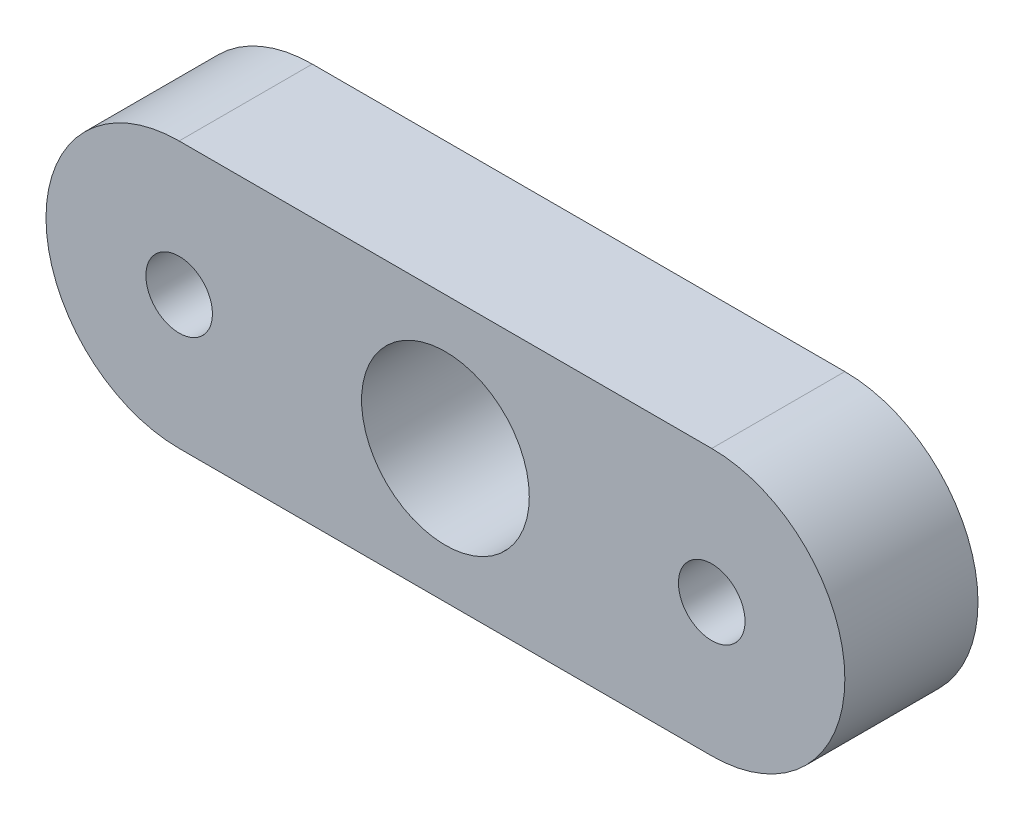
ISO-10303-21;
HEADER;
FILE_DESCRIPTION(('STEP AP214'),'2;1');
FILE_NAME('part.step','',(''),(''),'','','');
FILE_SCHEMA(('AUTOMOTIVE_DESIGN { 1 0 10303 214 1 1 1 1 }'));
ENDSEC;
DATA;
#1=APPLICATION_CONTEXT('core data for automotive mechanical design processes');
#2=APPLICATION_PROTOCOL_DEFINITION('international standard','automotive_design',2000,#1);
#3=PRODUCT_CONTEXT('',#1,'mechanical');
#4=PRODUCT('Part','Part','',(#3));
#5=PRODUCT_RELATED_PRODUCT_CATEGORY('part','',(#4));
#6=PRODUCT_DEFINITION_FORMATION('','',#4);
#7=PRODUCT_DEFINITION_CONTEXT('part definition',#1,'design');
#8=PRODUCT_DEFINITION('design','',#6,#7);
#9=PRODUCT_DEFINITION_SHAPE('','',#8);
#10=(LENGTH_UNIT() NAMED_UNIT(*) SI_UNIT(.MILLI.,.METRE.));
#11=(NAMED_UNIT(*) PLANE_ANGLE_UNIT() SI_UNIT($,.RADIAN.));
#12=(NAMED_UNIT(*) SI_UNIT($,.STERADIAN.) SOLID_ANGLE_UNIT());
#13=UNCERTAINTY_MEASURE_WITH_UNIT(LENGTH_MEASURE(1.E-05),#10,'distance_accuracy_value','');
#14=(GEOMETRIC_REPRESENTATION_CONTEXT(3) GLOBAL_UNCERTAINTY_ASSIGNED_CONTEXT((#13)) GLOBAL_UNIT_ASSIGNED_CONTEXT((#10,
#11,#12)) REPRESENTATION_CONTEXT('',''));
#15=CARTESIAN_POINT('',(0.,0.,0.));
#16=DIRECTION('',(0.,0.,1.));
#17=DIRECTION('',(1.,0.,0.));
#18=AXIS2_PLACEMENT_3D('',#15,#16,#17);
#19=CARTESIAN_POINT('',(-6.35,0.,3.175));
#20=DIRECTION('',(0.,0.,1.));
#21=DIRECTION('',(1.,0.,0.));
#22=AXIS2_PLACEMENT_3D('',#19,#20,#21);
#23=PLANE('',#22);
#24=CARTESIAN_POINT('',(-6.35,0.,3.175));
#25=DIRECTION('',(0.,0.,1.));
#26=DIRECTION('',(1.,0.,0.));
#27=AXIS2_PLACEMENT_3D('',#24,#25,#26);
#28=CIRCLE('',#27,0.793750000000001);
#29=CARTESIAN_POINT('',(-5.55625,0.,3.175));
#30=VERTEX_POINT('',#29);
#31=EDGE_CURVE('E123',#30,#30,#28,.T.);
#32=ORIENTED_EDGE('',*,*,#31,.F.);
#33=EDGE_LOOP('',(#32));
#34=FACE_BOUND('',#33,.T.);
#35=CARTESIAN_POINT('',(-6.35,0.,3.175));
#36=DIRECTION('',(0.,0.,1.));
#37=DIRECTION('',(1.,0.,0.));
#38=AXIS2_PLACEMENT_3D('',#35,#36,#37);
#39=CIRCLE('',#38,3.175);
#40=CARTESIAN_POINT('',(-6.35,3.175,3.175));
#41=VERTEX_POINT('',#40);
#42=CARTESIAN_POINT('',(-6.35,-3.175,3.175));
#43=VERTEX_POINT('',#42);
#44=EDGE_CURVE('E93',#41,#43,#39,.T.);
#45=ORIENTED_EDGE('',*,*,#44,.T.);
#46=DIRECTION('',(1.,0.,0.));
#47=VECTOR('',#46,1.);
#48=CARTESIAN_POINT('',(-6.35,-3.175,3.175));
#49=LINE('',#48,#47);
#50=CARTESIAN_POINT('',(6.35,-3.175,3.175));
#51=VERTEX_POINT('',#50);
#52=EDGE_CURVE('E88',#43,#51,#49,.T.);
#53=ORIENTED_EDGE('',*,*,#52,.T.);
#54=CARTESIAN_POINT('',(6.35,0.,3.175));
#55=DIRECTION('',(0.,0.,1.));
#56=DIRECTION('',(1.,0.,0.));
#57=AXIS2_PLACEMENT_3D('',#54,#55,#56);
#58=CIRCLE('',#57,3.175);
#59=CARTESIAN_POINT('',(6.35,3.175,3.175));
#60=VERTEX_POINT('',#59);
#61=EDGE_CURVE('E91',#51,#60,#58,.T.);
#62=ORIENTED_EDGE('',*,*,#61,.T.);
#63=DIRECTION('',(-1.,0.,0.));
#64=VECTOR('',#63,1.);
#65=CARTESIAN_POINT('',(-6.35,3.175,3.175));
#66=LINE('',#65,#64);
#67=EDGE_CURVE('E58',#60,#41,#66,.T.);
#68=ORIENTED_EDGE('',*,*,#67,.T.);
#69=EDGE_LOOP('',(#45,#53,#62,#68));
#70=FACE_BOUND('',#69,.T.);
#71=CARTESIAN_POINT('',(0.,0.,3.175));
#72=DIRECTION('',(0.,0.,1.));
#73=DIRECTION('',(1.,0.,0.));
#74=AXIS2_PLACEMENT_3D('',#71,#72,#73);
#75=CIRCLE('',#74,2.);
#76=CARTESIAN_POINT('',(2.,0.,3.175));
#77=VERTEX_POINT('',#76);
#78=EDGE_CURVE('E108',#77,#77,#75,.T.);
#79=ORIENTED_EDGE('',*,*,#78,.F.);
#80=EDGE_LOOP('',(#79));
#81=FACE_BOUND('',#80,.T.);
#82=CARTESIAN_POINT('',(6.35,0.,3.175));
#83=DIRECTION('',(0.,0.,1.));
#84=DIRECTION('',(1.,0.,0.));
#85=AXIS2_PLACEMENT_3D('',#82,#83,#84);
#86=CIRCLE('',#85,0.79375);
#87=CARTESIAN_POINT('',(7.14375,0.,3.175));
#88=VERTEX_POINT('',#87);
#89=EDGE_CURVE('E129',#88,#88,#86,.T.);
#90=ORIENTED_EDGE('',*,*,#89,.F.);
#91=EDGE_LOOP('',(#90));
#92=FACE_BOUND('',#91,.T.);
#93=ADVANCED_FACE('F41',(#34,#70,#81,#92),#23,.T.);
#94=CARTESIAN_POINT('',(-6.35,0.,0.));
#95=DIRECTION('',(0.,0.,1.));
#96=DIRECTION('',(1.,0.,0.));
#97=AXIS2_PLACEMENT_3D('',#94,#95,#96);
#98=PLANE('',#97);
#99=CARTESIAN_POINT('',(-6.35,0.,0.));
#100=DIRECTION('',(0.,0.,1.));
#101=DIRECTION('',(1.,0.,0.));
#102=AXIS2_PLACEMENT_3D('',#99,#100,#101);
#103=CIRCLE('',#102,3.175);
#104=CARTESIAN_POINT('',(-6.35,3.175,0.));
#105=VERTEX_POINT('',#104);
#106=CARTESIAN_POINT('',(-6.35,-3.175,0.));
#107=VERTEX_POINT('',#106);
#108=EDGE_CURVE('E105',#105,#107,#103,.T.);
#109=ORIENTED_EDGE('',*,*,#108,.F.);
#110=DIRECTION('',(-1.,0.,0.));
#111=VECTOR('',#110,1.);
#112=CARTESIAN_POINT('',(-6.35,3.175,0.));
#113=LINE('',#112,#111);
#114=CARTESIAN_POINT('',(6.35,3.175,0.));
#115=VERTEX_POINT('',#114);
#116=EDGE_CURVE('E81',#115,#105,#113,.T.);
#117=ORIENTED_EDGE('',*,*,#116,.F.);
#118=CARTESIAN_POINT('',(6.35,0.,0.));
#119=DIRECTION('',(0.,0.,1.));
#120=DIRECTION('',(1.,0.,0.));
#121=AXIS2_PLACEMENT_3D('',#118,#119,#120);
#122=CIRCLE('',#121,3.175);
#123=CARTESIAN_POINT('',(6.35,-3.175,0.));
#124=VERTEX_POINT('',#123);
#125=EDGE_CURVE('E75',#124,#115,#122,.T.);
#126=ORIENTED_EDGE('',*,*,#125,.F.);
#127=DIRECTION('',(1.,0.,0.));
#128=VECTOR('',#127,1.);
#129=CARTESIAN_POINT('',(-6.35,-3.175,0.));
#130=LINE('',#129,#128);
#131=EDGE_CURVE('E97',#107,#124,#130,.T.);
#132=ORIENTED_EDGE('',*,*,#131,.F.);
#133=EDGE_LOOP('',(#109,#117,#126,#132));
#134=FACE_BOUND('',#133,.T.);
#135=CARTESIAN_POINT('',(0.,0.,0.));
#136=DIRECTION('',(0.,0.,1.));
#137=DIRECTION('',(1.,0.,0.));
#138=AXIS2_PLACEMENT_3D('',#135,#136,#137);
#139=CIRCLE('',#138,2.);
#140=CARTESIAN_POINT('',(2.,0.,0.));
#141=VERTEX_POINT('',#140);
#142=EDGE_CURVE('E120',#141,#141,#139,.T.);
#143=ORIENTED_EDGE('',*,*,#142,.T.);
#144=EDGE_LOOP('',(#143));
#145=FACE_BOUND('',#144,.T.);
#146=CARTESIAN_POINT('',(-6.35,0.,0.));
#147=DIRECTION('',(0.,0.,1.));
#148=DIRECTION('',(1.,0.,0.));
#149=AXIS2_PLACEMENT_3D('',#146,#147,#148);
#150=CIRCLE('',#149,0.793750000000001);
#151=CARTESIAN_POINT('',(-5.55625,0.,0.));
#152=VERTEX_POINT('',#151);
#153=EDGE_CURVE('E126',#152,#152,#150,.T.);
#154=ORIENTED_EDGE('',*,*,#153,.T.);
#155=EDGE_LOOP('',(#154));
#156=FACE_BOUND('',#155,.T.);
#157=CARTESIAN_POINT('',(6.35,0.,0.));
#158=DIRECTION('',(0.,0.,1.));
#159=DIRECTION('',(1.,0.,0.));
#160=AXIS2_PLACEMENT_3D('',#157,#158,#159);
#161=CIRCLE('',#160,0.79375);
#162=CARTESIAN_POINT('',(7.14375,0.,0.));
#163=VERTEX_POINT('',#162);
#164=EDGE_CURVE('E132',#163,#163,#161,.T.);
#165=ORIENTED_EDGE('',*,*,#164,.T.);
#166=EDGE_LOOP('',(#165));
#167=FACE_BOUND('',#166,.T.);
#168=ADVANCED_FACE('F116',(#134,#145,#156,#167),#98,.F.);
#169=CARTESIAN_POINT('',(-6.35,0.,3.175));
#170=DIRECTION('',(0.,0.,-1.));
#171=DIRECTION('',(-1.,0.,0.));
#172=AXIS2_PLACEMENT_3D('',#169,#170,#171);
#173=CYLINDRICAL_SURFACE('',#172,3.175);
#174=ORIENTED_EDGE('',*,*,#108,.T.);
#175=DIRECTION('',(0.,0.,-1.));
#176=VECTOR('',#175,1.);
#177=CARTESIAN_POINT('',(-6.35,-3.175,3.175));
#178=LINE('',#177,#176);
#179=EDGE_CURVE('E11',#43,#107,#178,.T.);
#180=ORIENTED_EDGE('',*,*,#179,.F.);
#181=ORIENTED_EDGE('',*,*,#44,.F.);
#182=DIRECTION('',(0.,0.,-1.));
#183=VECTOR('',#182,1.);
#184=CARTESIAN_POINT('',(-6.35,3.175,3.175));
#185=LINE('',#184,#183);
#186=EDGE_CURVE('E101',#41,#105,#185,.T.);
#187=ORIENTED_EDGE('',*,*,#186,.T.);
#188=EDGE_LOOP('',(#174,#180,#181,#187));
#189=FACE_BOUND('',#188,.T.);
#190=ADVANCED_FACE('F43',(#189),#173,.T.);
#191=CARTESIAN_POINT('',(-6.35,-3.175,3.175));
#192=DIRECTION('',(0.,1.,0.));
#193=DIRECTION('',(-1.,0.,0.));
#194=AXIS2_PLACEMENT_3D('',#191,#192,#193);
#195=PLANE('',#194);
#196=ORIENTED_EDGE('',*,*,#131,.T.);
#197=DIRECTION('',(0.,0.,-1.));
#198=VECTOR('',#197,1.);
#199=CARTESIAN_POINT('',(6.35,-3.175,3.175));
#200=LINE('',#199,#198);
#201=EDGE_CURVE('E50',#51,#124,#200,.T.);
#202=ORIENTED_EDGE('',*,*,#201,.F.);
#203=ORIENTED_EDGE('',*,*,#52,.F.);
#204=ORIENTED_EDGE('',*,*,#179,.T.);
#205=EDGE_LOOP('',(#196,#202,#203,#204));
#206=FACE_BOUND('',#205,.T.);
#207=ADVANCED_FACE('F96',(#206),#195,.F.);
#208=CARTESIAN_POINT('',(6.35,0.,3.175));
#209=DIRECTION('',(0.,0.,-1.));
#210=DIRECTION('',(-1.,0.,0.));
#211=AXIS2_PLACEMENT_3D('',#208,#209,#210);
#212=CYLINDRICAL_SURFACE('',#211,3.175);
#213=ORIENTED_EDGE('',*,*,#125,.T.);
#214=DIRECTION('',(0.,0.,-1.));
#215=VECTOR('',#214,1.);
#216=CARTESIAN_POINT('',(6.35,3.175,3.175));
#217=LINE('',#216,#215);
#218=EDGE_CURVE('E98',#60,#115,#217,.T.);
#219=ORIENTED_EDGE('',*,*,#218,.F.);
#220=ORIENTED_EDGE('',*,*,#61,.F.);
#221=ORIENTED_EDGE('',*,*,#201,.T.);
#222=EDGE_LOOP('',(#213,#219,#220,#221));
#223=FACE_BOUND('',#222,.T.);
#224=ADVANCED_FACE('F99',(#223),#212,.T.);
#225=CARTESIAN_POINT('',(-6.35,3.175,3.175));
#226=DIRECTION('',(0.,-1.,0.));
#227=DIRECTION('',(1.,0.,0.));
#228=AXIS2_PLACEMENT_3D('',#225,#226,#227);
#229=PLANE('',#228);
#230=ORIENTED_EDGE('',*,*,#116,.T.);
#231=ORIENTED_EDGE('',*,*,#186,.F.);
#232=ORIENTED_EDGE('',*,*,#67,.F.);
#233=ORIENTED_EDGE('',*,*,#218,.T.);
#234=EDGE_LOOP('',(#230,#231,#232,#233));
#235=FACE_BOUND('',#234,.T.);
#236=ADVANCED_FACE('F113',(#235),#229,.F.);
#237=CARTESIAN_POINT('',(0.,0.,3.175));
#238=DIRECTION('',(0.,0.,-1.));
#239=DIRECTION('',(-1.,0.,0.));
#240=AXIS2_PLACEMENT_3D('',#237,#238,#239);
#241=CYLINDRICAL_SURFACE('',#240,2.);
#242=ORIENTED_EDGE('',*,*,#78,.T.);
#243=EDGE_LOOP('',(#242));
#244=FACE_BOUND('',#243,.T.);
#245=ORIENTED_EDGE('',*,*,#142,.F.);
#246=EDGE_LOOP('',(#245));
#247=FACE_BOUND('',#246,.T.);
#248=ADVANCED_FACE('F150',(#244,#247),#241,.F.);
#249=CARTESIAN_POINT('',(-6.35,0.,3.175));
#250=DIRECTION('',(0.,0.,-1.));
#251=DIRECTION('',(-1.,0.,0.));
#252=AXIS2_PLACEMENT_3D('',#249,#250,#251);
#253=CYLINDRICAL_SURFACE('',#252,0.793750000000001);
#254=ORIENTED_EDGE('',*,*,#31,.T.);
#255=EDGE_LOOP('',(#254));
#256=FACE_BOUND('',#255,.T.);
#257=ORIENTED_EDGE('',*,*,#153,.F.);
#258=EDGE_LOOP('',(#257));
#259=FACE_BOUND('',#258,.T.);
#260=ADVANCED_FACE('F204',(#256,#259),#253,.F.);
#261=CARTESIAN_POINT('',(6.35,0.,3.175));
#262=DIRECTION('',(0.,0.,-1.));
#263=DIRECTION('',(-1.,0.,0.));
#264=AXIS2_PLACEMENT_3D('',#261,#262,#263);
#265=CYLINDRICAL_SURFACE('',#264,0.79375);
#266=ORIENTED_EDGE('',*,*,#89,.T.);
#267=EDGE_LOOP('',(#266));
#268=FACE_BOUND('',#267,.T.);
#269=ORIENTED_EDGE('',*,*,#164,.F.);
#270=EDGE_LOOP('',(#269));
#271=FACE_BOUND('',#270,.T.);
#272=ADVANCED_FACE('F138',(#268,#271),#265,.F.);
#273=CLOSED_SHELL('',(#93,#168,#190,#207,#224,#236,#248,#260,#272));
#274=MANIFOLD_SOLID_BREP('B2',#273);
#275=ADVANCED_BREP_SHAPE_REPRESENTATION('',(#18,#274),#14);
#276=SHAPE_DEFINITION_REPRESENTATION(#9,#275);
ENDSEC;
END-ISO-10303-21;
